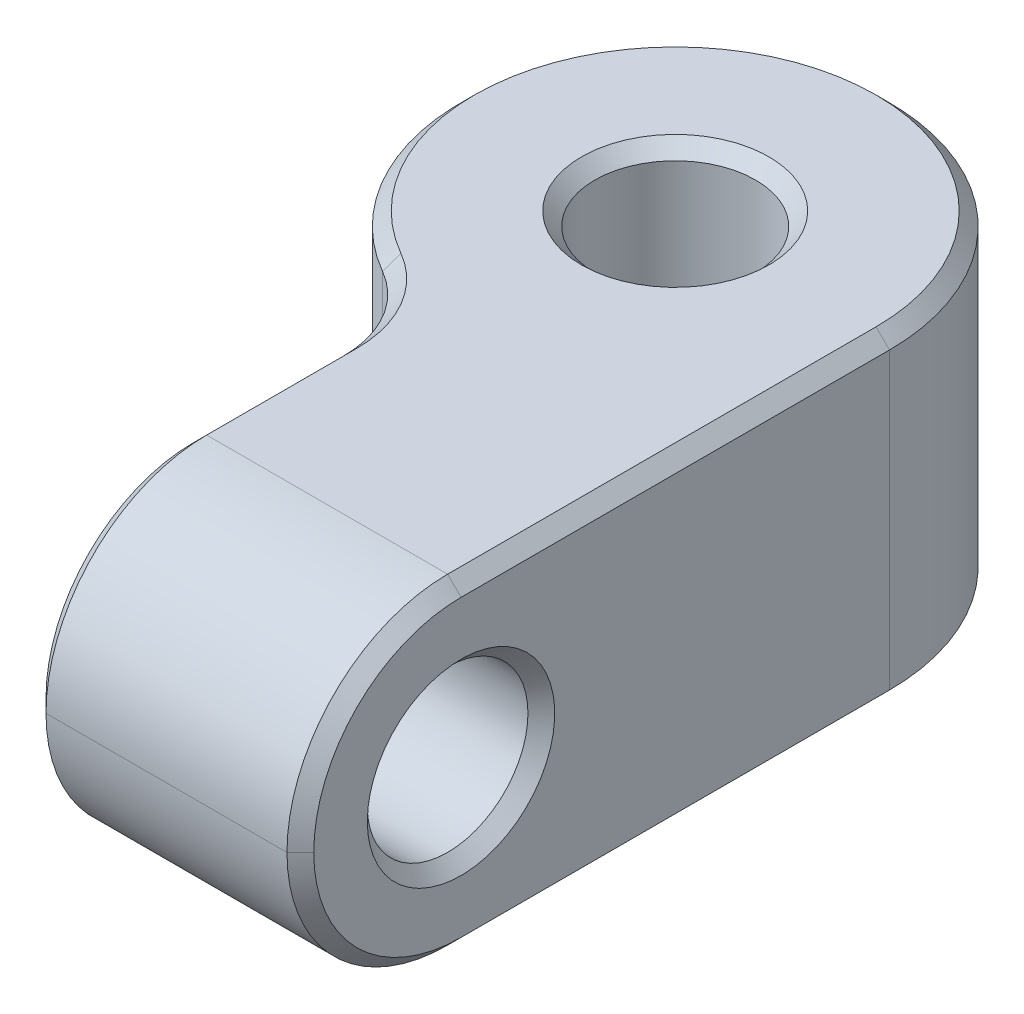
ISO-10303-21;
HEADER;
FILE_DESCRIPTION(('STEP AP214'),'2;1');
FILE_NAME('part.step','',(''),(''),'','','');
FILE_SCHEMA(('AUTOMOTIVE_DESIGN { 1 0 10303 214 1 1 1 1 }'));
ENDSEC;
DATA;
#1=APPLICATION_CONTEXT('core data for automotive mechanical design processes');
#2=APPLICATION_PROTOCOL_DEFINITION('international standard','automotive_design',2000,#1);
#3=PRODUCT_CONTEXT('',#1,'mechanical');
#4=PRODUCT('Part','Part','',(#3));
#5=PRODUCT_RELATED_PRODUCT_CATEGORY('part','',(#4));
#6=PRODUCT_DEFINITION_FORMATION('','',#4);
#7=PRODUCT_DEFINITION_CONTEXT('part definition',#1,'design');
#8=PRODUCT_DEFINITION('design','',#6,#7);
#9=PRODUCT_DEFINITION_SHAPE('','',#8);
#10=(LENGTH_UNIT() NAMED_UNIT(*) SI_UNIT(.MILLI.,.METRE.));
#11=(NAMED_UNIT(*) PLANE_ANGLE_UNIT() SI_UNIT($,.RADIAN.));
#12=(NAMED_UNIT(*) SI_UNIT($,.STERADIAN.) SOLID_ANGLE_UNIT());
#13=UNCERTAINTY_MEASURE_WITH_UNIT(LENGTH_MEASURE(1.E-05),#10,'distance_accuracy_value','');
#14=(GEOMETRIC_REPRESENTATION_CONTEXT(3) GLOBAL_UNCERTAINTY_ASSIGNED_CONTEXT((#13)) GLOBAL_UNIT_ASSIGNED_CONTEXT((#10,
#11,#12)) REPRESENTATION_CONTEXT('',''));
#15=CARTESIAN_POINT('',(0.,0.,0.));
#16=DIRECTION('',(0.,0.,1.));
#17=DIRECTION('',(1.,0.,0.));
#18=AXIS2_PLACEMENT_3D('',#15,#16,#17);
#19=CARTESIAN_POINT('',(0.,9.525,0.));
#20=DIRECTION('',(0.,1.,0.));
#21=DIRECTION('',(0.,0.,1.));
#22=AXIS2_PLACEMENT_3D('',#19,#20,#21);
#23=PLANE('',#22);
#24=CARTESIAN_POINT('',(0.,9.525,0.));
#25=DIRECTION('',(0.,1.,0.));
#26=DIRECTION('',(0.,0.,1.));
#27=AXIS2_PLACEMENT_3D('',#24,#25,#26);
#28=CIRCLE('',#27,2.77812500000001);
#29=CARTESIAN_POINT('',(0.,9.525,2.77812500000001));
#30=VERTEX_POINT('',#29);
#31=EDGE_CURVE('E151',#30,#30,#28,.F.);
#32=ORIENTED_EDGE('',*,*,#31,.T.);
#33=EDGE_LOOP('',(#32));
#34=FACE_BOUND('',#33,.T.);
#35=DIRECTION('',(1.,0.,0.));
#36=VECTOR('',#35,1.);
#37=CARTESIAN_POINT('',(6.35,9.525,12.7));
#38=LINE('',#37,#36);
#39=CARTESIAN_POINT('',(-1.19062500000002,9.525,12.7));
#40=VERTEX_POINT('',#39);
#41=CARTESIAN_POINT('',(5.95312500000002,9.525,12.7));
#42=VERTEX_POINT('',#41);
#43=EDGE_CURVE('E317',#40,#42,#38,.T.);
#44=ORIENTED_EDGE('',*,*,#43,.T.);
#45=DIRECTION('',(0.,0.,-1.));
#46=VECTOR('',#45,1.);
#47=CARTESIAN_POINT('',(5.95312500000002,9.525,0.));
#48=LINE('',#47,#46);
#49=CARTESIAN_POINT('',(5.95312500000002,9.525,0.));
#50=VERTEX_POINT('',#49);
#51=EDGE_CURVE('E238',#42,#50,#48,.T.);
#52=ORIENTED_EDGE('',*,*,#51,.T.);
#53=CARTESIAN_POINT('',(0.,9.525,0.));
#54=DIRECTION('',(0.,1.,0.));
#55=DIRECTION('',(0.,0.,1.));
#56=AXIS2_PLACEMENT_3D('',#53,#54,#55);
#57=CIRCLE('',#56,5.95312500000002);
#58=CARTESIAN_POINT('',(-2.97656250000001,9.525,5.15555748190425));
#59=VERTEX_POINT('',#58);
#60=EDGE_CURVE('E168',#50,#59,#57,.T.);
#61=ORIENTED_EDGE('',*,*,#60,.T.);
#62=CARTESIAN_POINT('',(-4.7625,9.525,8.24889197104678));
#63=DIRECTION('',(0.,1.,0.));
#64=DIRECTION('',(0.,0.,1.));
#65=AXIS2_PLACEMENT_3D('',#62,#63,#64);
#66=CIRCLE('',#65,3.57187499999998);
#67=CARTESIAN_POINT('',(-1.19062500000002,9.525,8.24889197104678));
#68=VERTEX_POINT('',#67);
#69=EDGE_CURVE('E232',#59,#68,#66,.F.);
#70=ORIENTED_EDGE('',*,*,#69,.T.);
#71=DIRECTION('',(0.,0.,1.));
#72=VECTOR('',#71,1.);
#73=CARTESIAN_POINT('',(-1.19062500000002,9.525,12.7));
#74=LINE('',#73,#72);
#75=EDGE_CURVE('E235',#68,#40,#74,.T.);
#76=ORIENTED_EDGE('',*,*,#75,.T.);
#77=EDGE_LOOP('',(#44,#52,#61,#70,#76));
#78=FACE_BOUND('',#77,.T.);
#79=ADVANCED_FACE('F43',(#34,#78),#23,.T.);
#80=CARTESIAN_POINT('',(0.,0.,0.));
#81=DIRECTION('',(0.,1.,0.));
#82=DIRECTION('',(0.,0.,1.));
#83=AXIS2_PLACEMENT_3D('',#80,#81,#82);
#84=PLANE('',#83);
#85=CARTESIAN_POINT('',(0.,0.,0.));
#86=DIRECTION('',(0.,1.,0.));
#87=DIRECTION('',(0.,0.,1.));
#88=AXIS2_PLACEMENT_3D('',#85,#86,#87);
#89=CIRCLE('',#88,2.77812499999999);
#90=CARTESIAN_POINT('',(0.,0.,2.77812499999999));
#91=VERTEX_POINT('',#90);
#92=EDGE_CURVE('E246',#91,#91,#89,.T.);
#93=ORIENTED_EDGE('',*,*,#92,.T.);
#94=EDGE_LOOP('',(#93));
#95=FACE_BOUND('',#94,.T.);
#96=CARTESIAN_POINT('',(0.,0.,0.));
#97=DIRECTION('',(0.,1.,0.));
#98=DIRECTION('',(0.,0.,1.));
#99=AXIS2_PLACEMENT_3D('',#96,#97,#98);
#100=CIRCLE('',#99,5.95312500000002);
#101=CARTESIAN_POINT('',(-2.97656250000001,0.,5.15555748190425));
#102=VERTEX_POINT('',#101);
#103=CARTESIAN_POINT('',(5.95312500000002,0.,0.));
#104=VERTEX_POINT('',#103);
#105=EDGE_CURVE('E256',#102,#104,#100,.F.);
#106=ORIENTED_EDGE('',*,*,#105,.T.);
#107=DIRECTION('',(0.,0.,1.));
#108=VECTOR('',#107,1.);
#109=CARTESIAN_POINT('',(5.95312500000002,0.,0.));
#110=LINE('',#109,#108);
#111=CARTESIAN_POINT('',(5.95312500000002,0.,12.7));
#112=VERTEX_POINT('',#111);
#113=EDGE_CURVE('E260',#104,#112,#110,.T.);
#114=ORIENTED_EDGE('',*,*,#113,.T.);
#115=DIRECTION('',(1.,0.,0.));
#116=VECTOR('',#115,1.);
#117=CARTESIAN_POINT('',(0.,0.,12.7));
#118=LINE('',#117,#116);
#119=CARTESIAN_POINT('',(-1.19062500000002,0.,12.7));
#120=VERTEX_POINT('',#119);
#121=EDGE_CURVE('E161',#112,#120,#118,.F.);
#122=ORIENTED_EDGE('',*,*,#121,.T.);
#123=DIRECTION('',(0.,0.,-1.));
#124=VECTOR('',#123,1.);
#125=CARTESIAN_POINT('',(-1.19062500000002,0.,0.));
#126=LINE('',#125,#124);
#127=CARTESIAN_POINT('',(-1.19062500000002,0.,8.24889197104678));
#128=VERTEX_POINT('',#127);
#129=EDGE_CURVE('E250',#120,#128,#126,.T.);
#130=ORIENTED_EDGE('',*,*,#129,.T.);
#131=CARTESIAN_POINT('',(-4.7625,0.,8.24889197104678));
#132=DIRECTION('',(0.,1.,0.));
#133=DIRECTION('',(0.,0.,1.));
#134=AXIS2_PLACEMENT_3D('',#131,#132,#133);
#135=CIRCLE('',#134,3.57187499999998);
#136=EDGE_CURVE('E253',#128,#102,#135,.T.);
#137=ORIENTED_EDGE('',*,*,#136,.T.);
#138=EDGE_LOOP('',(#106,#114,#122,#130,#137));
#139=FACE_BOUND('',#138,.T.);
#140=ADVANCED_FACE('F331',(#95,#139),#84,.F.);
#141=CARTESIAN_POINT('',(6.35,9.525,17.4625));
#142=DIRECTION('',(-1.,0.,0.));
#143=DIRECTION('',(0.,0.,1.));
#144=AXIS2_PLACEMENT_3D('',#141,#142,#143);
#145=PLANE('',#144);
#146=CARTESIAN_POINT('',(6.35,4.7625,12.7));
#147=DIRECTION('',(-1.,0.,0.));
#148=DIRECTION('',(0.,0.,1.));
#149=AXIS2_PLACEMENT_3D('',#146,#147,#148);
#150=CIRCLE('',#149,2.778125);
#151=CARTESIAN_POINT('',(6.35,4.7625,15.478125));
#152=VERTEX_POINT('',#151);
#153=EDGE_CURVE('E194',#152,#152,#150,.T.);
#154=ORIENTED_EDGE('',*,*,#153,.T.);
#155=EDGE_LOOP('',(#154));
#156=FACE_BOUND('',#155,.T.);
#157=CARTESIAN_POINT('',(6.35,4.7625,12.7));
#158=DIRECTION('',(-1.,0.,0.));
#159=DIRECTION('',(0.,0.,1.));
#160=AXIS2_PLACEMENT_3D('',#157,#158,#159);
#161=CIRCLE('',#160,4.36562500000002);
#162=CARTESIAN_POINT('',(6.35,4.7625,17.065625));
#163=VERTEX_POINT('',#162);
#164=CARTESIAN_POINT('',(6.35,0.396874999999985,12.7));
#165=VERTEX_POINT('',#164);
#166=EDGE_CURVE('E184',#163,#165,#161,.F.);
#167=ORIENTED_EDGE('',*,*,#166,.T.);
#168=DIRECTION('',(0.,0.,-1.));
#169=VECTOR('',#168,1.);
#170=CARTESIAN_POINT('',(6.35,0.396874999999984,17.4625));
#171=LINE('',#170,#169);
#172=CARTESIAN_POINT('',(6.35,0.396874999999988,0.));
#173=VERTEX_POINT('',#172);
#174=EDGE_CURVE('E159',#165,#173,#171,.T.);
#175=ORIENTED_EDGE('',*,*,#174,.T.);
#176=DIRECTION('',(0.,-1.,0.));
#177=VECTOR('',#176,1.);
#178=CARTESIAN_POINT('',(6.35,9.525,0.));
#179=LINE('',#178,#177);
#180=CARTESIAN_POINT('',(6.35,9.12812500000002,0.));
#181=VERTEX_POINT('',#180);
#182=EDGE_CURVE('E141',#181,#173,#179,.T.);
#183=ORIENTED_EDGE('',*,*,#182,.F.);
#184=DIRECTION('',(0.,0.,1.));
#185=VECTOR('',#184,1.);
#186=CARTESIAN_POINT('',(6.35,9.12812500000002,12.7));
#187=LINE('',#186,#185);
#188=CARTESIAN_POINT('',(6.35,9.12812500000002,12.7));
#189=VERTEX_POINT('',#188);
#190=EDGE_CURVE('E156',#181,#189,#187,.T.);
#191=ORIENTED_EDGE('',*,*,#190,.T.);
#192=CARTESIAN_POINT('',(6.35,4.7625,12.7));
#193=DIRECTION('',(-1.,0.,0.));
#194=DIRECTION('',(0.,0.,1.));
#195=AXIS2_PLACEMENT_3D('',#192,#193,#194);
#196=CIRCLE('',#195,4.36562500000002);
#197=EDGE_CURVE('E180',#189,#163,#196,.F.);
#198=ORIENTED_EDGE('',*,*,#197,.T.);
#199=EDGE_LOOP('',(#167,#175,#183,#191,#198));
#200=FACE_BOUND('',#199,.T.);
#201=ADVANCED_FACE('F154',(#156,#200),#145,.F.);
#202=CARTESIAN_POINT('',(0.,9.525,0.));
#203=DIRECTION('',(0.,-1.,0.));
#204=DIRECTION('',(0.,0.,-1.));
#205=AXIS2_PLACEMENT_3D('',#202,#203,#204);
#206=CYLINDRICAL_SURFACE('',#205,6.35);
#207=ORIENTED_EDGE('',*,*,#182,.T.);
#208=CARTESIAN_POINT('',(0.,0.396874999999984,0.));
#209=DIRECTION('',(0.,1.,0.));
#210=DIRECTION('',(0.,0.,1.));
#211=AXIS2_PLACEMENT_3D('',#208,#209,#210);
#212=CIRCLE('',#211,6.35);
#213=CARTESIAN_POINT('',(-3.175,0.396874999999988,5.49926131403119));
#214=VERTEX_POINT('',#213);
#215=EDGE_CURVE('E150',#173,#214,#212,.T.);
#216=ORIENTED_EDGE('',*,*,#215,.T.);
#217=DIRECTION('',(0.,-1.,0.));
#218=VECTOR('',#217,1.);
#219=CARTESIAN_POINT('',(-3.175,9.525,5.49926131403119));
#220=LINE('',#219,#218);
#221=CARTESIAN_POINT('',(-3.175,9.12812500000002,5.49926131403119));
#222=VERTEX_POINT('',#221);
#223=EDGE_CURVE('E144',#214,#222,#220,.F.);
#224=ORIENTED_EDGE('',*,*,#223,.T.);
#225=CARTESIAN_POINT('',(0.,9.12812500000002,0.));
#226=DIRECTION('',(0.,1.,0.));
#227=DIRECTION('',(0.,0.,1.));
#228=AXIS2_PLACEMENT_3D('',#225,#226,#227);
#229=CIRCLE('',#228,6.35);
#230=EDGE_CURVE('E137',#222,#181,#229,.F.);
#231=ORIENTED_EDGE('',*,*,#230,.T.);
#232=EDGE_LOOP('',(#207,#216,#224,#231));
#233=FACE_BOUND('',#232,.T.);
#234=ADVANCED_FACE('F139',(#233),#206,.T.);
#235=CARTESIAN_POINT('',(-1.5875,9.525,17.4625));
#236=DIRECTION('',(1.,0.,0.));
#237=DIRECTION('',(0.,0.,-1.));
#238=AXIS2_PLACEMENT_3D('',#235,#236,#237);
#239=PLANE('',#238);
#240=CARTESIAN_POINT('',(-1.5875,4.7625,12.7));
#241=DIRECTION('',(1.,0.,0.));
#242=DIRECTION('',(0.,0.,-1.));
#243=AXIS2_PLACEMENT_3D('',#240,#241,#242);
#244=CIRCLE('',#243,2.778125);
#245=CARTESIAN_POINT('',(-1.5875,4.7625,9.921875));
#246=VERTEX_POINT('',#245);
#247=EDGE_CURVE('E218',#246,#246,#244,.T.);
#248=ORIENTED_EDGE('',*,*,#247,.T.);
#249=EDGE_LOOP('',(#248));
#250=FACE_BOUND('',#249,.T.);
#251=DIRECTION('',(0.,1.,0.));
#252=VECTOR('',#251,1.);
#253=CARTESIAN_POINT('',(-1.5875,0.,8.24889197104678));
#254=LINE('',#253,#252);
#255=CARTESIAN_POINT('',(-1.5875,9.12812500000002,8.24889197104678));
#256=VERTEX_POINT('',#255);
#257=CARTESIAN_POINT('',(-1.5875,0.396874999999984,8.24889197104678));
#258=VERTEX_POINT('',#257);
#259=EDGE_CURVE('E186',#256,#258,#254,.F.);
#260=ORIENTED_EDGE('',*,*,#259,.T.);
#261=DIRECTION('',(0.,0.,1.));
#262=VECTOR('',#261,1.);
#263=CARTESIAN_POINT('',(-1.5875,0.396874999999984,17.4625));
#264=LINE('',#263,#262);
#265=CARTESIAN_POINT('',(-1.5875,0.396874999999985,12.7));
#266=VERTEX_POINT('',#265);
#267=EDGE_CURVE('E215',#258,#266,#264,.T.);
#268=ORIENTED_EDGE('',*,*,#267,.T.);
#269=CARTESIAN_POINT('',(-1.5875,4.7625,12.7));
#270=DIRECTION('',(1.,0.,0.));
#271=DIRECTION('',(0.,0.,-1.));
#272=AXIS2_PLACEMENT_3D('',#269,#270,#271);
#273=CIRCLE('',#272,4.36562500000002);
#274=CARTESIAN_POINT('',(-1.5875,4.7625,17.065625));
#275=VERTEX_POINT('',#274);
#276=EDGE_CURVE('E212',#266,#275,#273,.F.);
#277=ORIENTED_EDGE('',*,*,#276,.T.);
#278=CARTESIAN_POINT('',(-1.5875,4.7625,12.7));
#279=DIRECTION('',(1.,0.,0.));
#280=DIRECTION('',(0.,0.,-1.));
#281=AXIS2_PLACEMENT_3D('',#278,#279,#280);
#282=CIRCLE('',#281,4.36562500000002);
#283=CARTESIAN_POINT('',(-1.5875,9.12812500000002,12.7));
#284=VERTEX_POINT('',#283);
#285=EDGE_CURVE('E209',#275,#284,#282,.F.);
#286=ORIENTED_EDGE('',*,*,#285,.T.);
#287=DIRECTION('',(0.,0.,-1.));
#288=VECTOR('',#287,1.);
#289=CARTESIAN_POINT('',(-1.5875,9.12812500000002,8.24889197104678));
#290=LINE('',#289,#288);
#291=EDGE_CURVE('E206',#284,#256,#290,.T.);
#292=ORIENTED_EDGE('',*,*,#291,.T.);
#293=EDGE_LOOP('',(#260,#268,#277,#286,#292));
#294=FACE_BOUND('',#293,.T.);
#295=ADVANCED_FACE('F366',(#250,#294),#239,.F.);
#296=CARTESIAN_POINT('',(0.,9.525,0.));
#297=DIRECTION('',(0.,-1.,0.));
#298=DIRECTION('',(0.,0.,-1.));
#299=AXIS2_PLACEMENT_3D('',#296,#297,#298);
#300=CYLINDRICAL_SURFACE('',#299,2.38125);
#301=CARTESIAN_POINT('',(0.,9.12812499999999,0.));
#302=DIRECTION('',(0.,1.,0.));
#303=DIRECTION('',(0.,0.,1.));
#304=AXIS2_PLACEMENT_3D('',#301,#302,#303);
#305=CIRCLE('',#304,2.38125);
#306=CARTESIAN_POINT('',(0.,9.12812499999999,-2.38125));
#307=VERTEX_POINT('',#306);
#308=EDGE_CURVE('E226',#307,#307,#305,.T.);
#309=CARTESIAN_POINT('',(0.,0.396874999999994,0.));
#310=DIRECTION('',(0.,1.,0.));
#311=DIRECTION('',(0.,0.,1.));
#312=AXIS2_PLACEMENT_3D('',#309,#310,#311);
#313=CIRCLE('',#312,2.38125);
#314=CARTESIAN_POINT('',(0.,0.396874999999994,-2.38125));
#315=VERTEX_POINT('',#314);
#316=EDGE_CURVE('E222',#315,#315,#313,.F.);
#317=CARTESIAN_POINT('',(0.,9.12812499999999,-2.38125));
#318=CARTESIAN_POINT('',(0.,9.03717447916666,-2.38125));
#319=CARTESIAN_POINT('',(0.,8.94622395833333,-2.38125));
#320=CARTESIAN_POINT('',(0.,8.76432291666666,-2.38125));
#321=CARTESIAN_POINT('',(0.,8.67337239583332,-2.38125));
#322=CARTESIAN_POINT('',(0.,8.49147135416666,-2.38125));
#323=CARTESIAN_POINT('',(0.,8.40052083333332,-2.38125));
#324=CARTESIAN_POINT('',(0.,8.21861979166666,-2.38125));
#325=CARTESIAN_POINT('',(0.,8.12766927083332,-2.38125));
#326=CARTESIAN_POINT('',(0.,7.94576822916666,-2.38125));
#327=CARTESIAN_POINT('',(0.,7.85481770833332,-2.38125));
#328=CARTESIAN_POINT('',(0.,7.67291666666666,-2.38125));
#329=CARTESIAN_POINT('',(0.,7.58196614583332,-2.38125));
#330=CARTESIAN_POINT('',(0.,7.40006510416666,-2.38125));
#331=CARTESIAN_POINT('',(0.,7.30911458333333,-2.38125));
#332=CARTESIAN_POINT('',(0.,7.12721354166666,-2.38125));
#333=CARTESIAN_POINT('',(0.,7.03626302083332,-2.38125));
#334=CARTESIAN_POINT('',(0.,6.85436197916666,-2.38125));
#335=CARTESIAN_POINT('',(0.,6.76341145833333,-2.38125));
#336=CARTESIAN_POINT('',(0.,6.58151041666666,-2.38125));
#337=CARTESIAN_POINT('',(0.,6.49055989583333,-2.38125));
#338=CARTESIAN_POINT('',(0.,6.30865885416666,-2.38125));
#339=CARTESIAN_POINT('',(0.,6.21770833333333,-2.38125));
#340=CARTESIAN_POINT('',(0.,6.03580729166666,-2.38125));
#341=CARTESIAN_POINT('',(0.,5.94485677083332,-2.38125));
#342=CARTESIAN_POINT('',(0.,5.76295572916666,-2.38125));
#343=CARTESIAN_POINT('',(0.,5.67200520833333,-2.38125));
#344=CARTESIAN_POINT('',(0.,5.49010416666666,-2.38125));
#345=CARTESIAN_POINT('',(0.,5.39915364583333,-2.38125));
#346=CARTESIAN_POINT('',(0.,5.21725260416666,-2.38125));
#347=CARTESIAN_POINT('',(0.,5.12630208333333,-2.38125));
#348=CARTESIAN_POINT('',(0.,4.94440104166666,-2.38125));
#349=CARTESIAN_POINT('',(0.,4.85345052083333,-2.38125));
#350=CARTESIAN_POINT('',(0.,4.67154947916666,-2.38125));
#351=CARTESIAN_POINT('',(0.,4.58059895833333,-2.38125));
#352=CARTESIAN_POINT('',(0.,4.39869791666666,-2.38125));
#353=CARTESIAN_POINT('',(0.,4.30774739583333,-2.38125));
#354=CARTESIAN_POINT('',(0.,4.12584635416666,-2.38125));
#355=CARTESIAN_POINT('',(0.,4.03489583333333,-2.38125));
#356=CARTESIAN_POINT('',(0.,3.85299479166666,-2.38125));
#357=CARTESIAN_POINT('',(0.,3.76204427083333,-2.38125));
#358=CARTESIAN_POINT('',(0.,3.58014322916666,-2.38125));
#359=CARTESIAN_POINT('',(0.,3.48919270833333,-2.38125));
#360=CARTESIAN_POINT('',(0.,3.30729166666666,-2.38125));
#361=CARTESIAN_POINT('',(0.,3.21634114583333,-2.38125));
#362=CARTESIAN_POINT('',(0.,3.03444010416666,-2.38125));
#363=CARTESIAN_POINT('',(0.,2.94348958333333,-2.38125));
#364=CARTESIAN_POINT('',(0.,2.76158854166666,-2.38125));
#365=CARTESIAN_POINT('',(0.,2.67063802083333,-2.38125));
#366=CARTESIAN_POINT('',(0.,2.48873697916666,-2.38125));
#367=CARTESIAN_POINT('',(0.,2.39778645833333,-2.38125));
#368=CARTESIAN_POINT('',(0.,2.21588541666666,-2.38125));
#369=CARTESIAN_POINT('',(0.,2.12493489583333,-2.38125));
#370=CARTESIAN_POINT('',(0.,1.94303385416666,-2.38125));
#371=CARTESIAN_POINT('',(0.,1.85208333333333,-2.38125));
#372=CARTESIAN_POINT('',(0.,1.67018229166666,-2.38125));
#373=CARTESIAN_POINT('',(0.,1.57923177083333,-2.38125));
#374=CARTESIAN_POINT('',(0.,1.39733072916666,-2.38125));
#375=CARTESIAN_POINT('',(0.,1.30638020833333,-2.38125));
#376=CARTESIAN_POINT('',(0.,1.12447916666666,-2.38125));
#377=CARTESIAN_POINT('',(0.,1.03352864583333,-2.38125));
#378=CARTESIAN_POINT('',(0.,0.851627604166659,-2.38125));
#379=CARTESIAN_POINT('',(0.,0.760677083333326,-2.38125));
#380=CARTESIAN_POINT('',(0.,0.578776041666661,-2.38125));
#381=CARTESIAN_POINT('',(0.,0.487825520833328,-2.38125));
#382=CARTESIAN_POINT('',(0.,0.396874999999994,-2.38125));
#383=B_SPLINE_CURVE_WITH_KNOTS('',3,(#317,#318,#319,#320,#321,#322,#323,#324,#325,#326,#327,
#328,#329,#330,#331,#332,#333,#334,#335,#336,#337,#338,#339,#340,#341,#342,#343,#344,#345,#346,
#347,#348,#349,#350,#351,#352,#353,#354,#355,#356,#357,#358,#359,#360,#361,#362,#363,#364,#365,
#366,#367,#368,#369,#370,#371,#372,#373,#374,#375,#376,#377,#378,#379,#380,#381,#382),
.UNSPECIFIED.,.F.,.F.,(4,2,2,2,2,2,2,2,2,2,2,2,2,2,2,2,2,2,2,2,2,2,2,2,2,2,2,2,2,2,2,2,4),(0.,
0.272851562500001,0.545703125000002,0.8185546875,1.09140625,1.3642578125,1.637109375,
1.9099609375,2.1828125,2.4556640625,2.728515625,3.0013671875,3.27421875,3.5470703125,
3.819921875,4.0927734375,4.365625,4.6384765625,4.911328125,5.1841796875,5.45703125,5.7298828125,
6.002734375,6.2755859375,6.5484375,6.8212890625,7.094140625,7.3669921875,7.63984375,
7.9126953125,8.185546875,8.4583984375,8.73125),.UNSPECIFIED.);
#384=EDGE_CURVE('BSEAM382',#307,#315,#383,.T.);
#385=ORIENTED_EDGE('',*,*,#308,.T.);
#386=ORIENTED_EDGE('',*,*,#316,.T.);
#387=ORIENTED_EDGE('',*,*,#384,.T.);
#388=ORIENTED_EDGE('',*,*,#384,.F.);
#389=EDGE_LOOP('',(#385,#387,#386,#388));
#390=FACE_BOUND('',#389,.T.);
#391=ADVANCED_FACE('F382',(#390),#300,.F.);
#392=CARTESIAN_POINT('',(-6.35,4.7625,12.7));
#393=DIRECTION('',(1.,0.,0.));
#394=DIRECTION('',(0.,0.,-1.));
#395=AXIS2_PLACEMENT_3D('',#392,#393,#394);
#396=CYLINDRICAL_SURFACE('',#395,2.38125);
#397=CARTESIAN_POINT('',(5.953125,4.7625,12.7));
#398=DIRECTION('',(-1.,0.,0.));
#399=DIRECTION('',(0.,0.,1.));
#400=AXIS2_PLACEMENT_3D('',#397,#398,#399);
#401=CIRCLE('',#400,2.38125);
#402=CARTESIAN_POINT('',(5.953125,4.7625,15.08125));
#403=VERTEX_POINT('',#402);
#404=EDGE_CURVE('E202',#403,#403,#401,.F.);
#405=ORIENTED_EDGE('',*,*,#404,.T.);
#406=EDGE_LOOP('',(#405));
#407=FACE_BOUND('',#406,.T.);
#408=CARTESIAN_POINT('',(-1.190625,4.7625,12.7));
#409=DIRECTION('',(1.,0.,0.));
#410=DIRECTION('',(0.,0.,-1.));
#411=AXIS2_PLACEMENT_3D('',#408,#409,#410);
#412=CIRCLE('',#411,2.38125);
#413=CARTESIAN_POINT('',(-1.190625,4.7625,10.31875));
#414=VERTEX_POINT('',#413);
#415=EDGE_CURVE('E198',#414,#414,#412,.F.);
#416=ORIENTED_EDGE('',*,*,#415,.T.);
#417=EDGE_LOOP('',(#416));
#418=FACE_BOUND('',#417,.T.);
#419=ADVANCED_FACE('F398',(#407,#418),#396,.F.);
#420=CARTESIAN_POINT('',(0.,4.7625,12.7));
#421=DIRECTION('',(-1.,0.,0.));
#422=DIRECTION('',(0.,0.,1.));
#423=AXIS2_PLACEMENT_3D('',#420,#421,#422);
#424=CYLINDRICAL_SURFACE('',#423,4.7625);
#425=DIRECTION('',(1.,0.,0.));
#426=VECTOR('',#425,1.);
#427=CARTESIAN_POINT('',(-1.5875,4.7625,17.4625));
#428=LINE('',#427,#426);
#429=CARTESIAN_POINT('',(5.95312500000002,4.7625,17.4625));
#430=VERTEX_POINT('',#429);
#431=CARTESIAN_POINT('',(-1.19062500000002,4.7625,17.4625));
#432=VERTEX_POINT('',#431);
#433=EDGE_CURVE('E162',#430,#432,#428,.F.);
#434=ORIENTED_EDGE('',*,*,#433,.F.);
#435=CARTESIAN_POINT('',(5.95312500000002,4.7625,12.7));
#436=DIRECTION('',(-1.,0.,0.));
#437=DIRECTION('',(0.,0.,1.));
#438=AXIS2_PLACEMENT_3D('',#435,#436,#437);
#439=CIRCLE('',#438,4.7625);
#440=EDGE_CURVE('E11',#430,#42,#439,.T.);
#441=ORIENTED_EDGE('',*,*,#440,.T.);
#442=ORIENTED_EDGE('',*,*,#43,.F.);
#443=CARTESIAN_POINT('',(-1.19062500000002,4.7625,12.7));
#444=DIRECTION('',(1.,0.,0.));
#445=DIRECTION('',(0.,0.,-1.));
#446=AXIS2_PLACEMENT_3D('',#443,#444,#445);
#447=CIRCLE('',#446,4.7625);
#448=EDGE_CURVE('E54',#40,#432,#447,.T.);
#449=ORIENTED_EDGE('',*,*,#448,.T.);
#450=EDGE_LOOP('',(#434,#441,#442,#449));
#451=FACE_BOUND('',#450,.T.);
#452=ADVANCED_FACE('F360',(#451),#424,.T.);
#453=CARTESIAN_POINT('',(-1.5875,4.7625,12.7));
#454=DIRECTION('',(1.,0.,0.));
#455=DIRECTION('',(0.,0.,-1.));
#456=AXIS2_PLACEMENT_3D('',#453,#454,#455);
#457=CYLINDRICAL_SURFACE('',#456,4.7625);
#458=ORIENTED_EDGE('',*,*,#121,.F.);
#459=CARTESIAN_POINT('',(5.95312500000002,4.7625,12.7));
#460=DIRECTION('',(-1.,0.,0.));
#461=DIRECTION('',(0.,0.,1.));
#462=AXIS2_PLACEMENT_3D('',#459,#460,#461);
#463=CIRCLE('',#462,4.7625);
#464=EDGE_CURVE('E68',#112,#430,#463,.T.);
#465=ORIENTED_EDGE('',*,*,#464,.T.);
#466=ORIENTED_EDGE('',*,*,#433,.T.);
#467=CARTESIAN_POINT('',(-1.19062500000002,4.7625,12.7));
#468=DIRECTION('',(1.,0.,0.));
#469=DIRECTION('',(0.,0.,-1.));
#470=AXIS2_PLACEMENT_3D('',#467,#468,#469);
#471=CIRCLE('',#470,4.7625);
#472=EDGE_CURVE('E269',#432,#120,#471,.T.);
#473=ORIENTED_EDGE('',*,*,#472,.T.);
#474=EDGE_LOOP('',(#458,#465,#466,#473));
#475=FACE_BOUND('',#474,.T.);
#476=ADVANCED_FACE('F393',(#475),#457,.T.);
#477=CARTESIAN_POINT('',(-4.7625,9.525,8.24889197104678));
#478=DIRECTION('',(0.,-1.,0.));
#479=DIRECTION('',(0.,0.,-1.));
#480=AXIS2_PLACEMENT_3D('',#477,#478,#479);
#481=CYLINDRICAL_SURFACE('',#480,3.175);
#482=ORIENTED_EDGE('',*,*,#223,.F.);
#483=CARTESIAN_POINT('',(-4.7625,0.396874999999984,8.24889197104678));
#484=DIRECTION('',(0.,1.,0.));
#485=DIRECTION('',(0.,0.,1.));
#486=AXIS2_PLACEMENT_3D('',#483,#484,#485);
#487=CIRCLE('',#486,3.175);
#488=EDGE_CURVE('E266',#214,#258,#487,.F.);
#489=ORIENTED_EDGE('',*,*,#488,.T.);
#490=ORIENTED_EDGE('',*,*,#259,.F.);
#491=CARTESIAN_POINT('',(-4.7625,9.12812500000002,8.24889197104678));
#492=DIRECTION('',(0.,1.,0.));
#493=DIRECTION('',(0.,0.,1.));
#494=AXIS2_PLACEMENT_3D('',#491,#492,#493);
#495=CIRCLE('',#494,3.175);
#496=EDGE_CURVE('E263',#256,#222,#495,.T.);
#497=ORIENTED_EDGE('',*,*,#496,.T.);
#498=EDGE_LOOP('',(#482,#489,#490,#497));
#499=FACE_BOUND('',#498,.T.);
#500=ADVANCED_FACE('F369',(#499),#481,.F.);
#501=CARTESIAN_POINT('',(6.35,4.7625,12.7));
#502=DIRECTION('',(1.,0.,0.));
#503=DIRECTION('',(0.,0.,-1.));
#504=AXIS2_PLACEMENT_3D('',#501,#502,#503);
#505=CONICAL_SURFACE('',#504,2.778125,0.785398163397446);
#506=ORIENTED_EDGE('',*,*,#404,.F.);
#507=EDGE_LOOP('',(#506));
#508=FACE_BOUND('',#507,.T.);
#509=ORIENTED_EDGE('',*,*,#153,.F.);
#510=EDGE_LOOP('',(#509));
#511=FACE_BOUND('',#510,.T.);
#512=ADVANCED_FACE('F401',(#508,#511),#505,.F.);
#513=CARTESIAN_POINT('',(-1.5875,4.7625,12.7));
#514=DIRECTION('',(-1.,0.,0.));
#515=DIRECTION('',(0.,0.,1.));
#516=AXIS2_PLACEMENT_3D('',#513,#514,#515);
#517=CONICAL_SURFACE('',#516,2.778125,0.785398163397447);
#518=ORIENTED_EDGE('',*,*,#415,.F.);
#519=EDGE_LOOP('',(#518));
#520=FACE_BOUND('',#519,.T.);
#521=ORIENTED_EDGE('',*,*,#247,.F.);
#522=EDGE_LOOP('',(#521));
#523=FACE_BOUND('',#522,.T.);
#524=ADVANCED_FACE('F408',(#520,#523),#517,.F.);
#525=CARTESIAN_POINT('',(0.,9.12812499999999,0.));
#526=DIRECTION('',(0.,1.,0.));
#527=DIRECTION('',(0.,0.,1.));
#528=AXIS2_PLACEMENT_3D('',#525,#526,#527);
#529=CONICAL_SURFACE('',#528,2.38125,0.785398163397449);
#530=ORIENTED_EDGE('',*,*,#31,.F.);
#531=EDGE_LOOP('',(#530));
#532=FACE_BOUND('',#531,.T.);
#533=ORIENTED_EDGE('',*,*,#308,.F.);
#534=EDGE_LOOP('',(#533));
#535=FACE_BOUND('',#534,.T.);
#536=ADVANCED_FACE('F415',(#532,#535),#529,.F.);
#537=CARTESIAN_POINT('',(-4.7625,9.525,8.24889197104678));
#538=DIRECTION('',(0.,1.,0.));
#539=DIRECTION('',(0.,0.,1.));
#540=AXIS2_PLACEMENT_3D('',#537,#538,#539);
#541=CONICAL_SURFACE('',#540,3.57187499999998,0.785398163397446);
#542=DIRECTION('',(-0.707106781186546,-0.707106781186549,0.));
#543=VECTOR('',#542,1.);
#544=CARTESIAN_POINT('',(-1.19062500000002,9.525,8.24889197104678));
#545=LINE('',#544,#543);
#546=EDGE_CURVE('E172',#68,#256,#545,.T.);
#547=ORIENTED_EDGE('',*,*,#546,.F.);
#548=ORIENTED_EDGE('',*,*,#69,.F.);
#549=DIRECTION('',(0.353553390593273,0.70710678118655,-0.612372435695793));
#550=VECTOR('',#549,1.);
#551=CARTESIAN_POINT('',(-3.175,9.12812500000002,5.49926131403118));
#552=LINE('',#551,#550);
#553=EDGE_CURVE('E48',#222,#59,#552,.T.);
#554=ORIENTED_EDGE('',*,*,#553,.F.);
#555=ORIENTED_EDGE('',*,*,#496,.F.);
#556=EDGE_LOOP('',(#547,#548,#554,#555));
#557=FACE_BOUND('',#556,.T.);
#558=ADVANCED_FACE('F371',(#557),#541,.F.);
#559=CARTESIAN_POINT('',(0.,9.525,0.));
#560=DIRECTION('',(0.,-1.,0.));
#561=DIRECTION('',(0.,0.,-1.));
#562=AXIS2_PLACEMENT_3D('',#559,#560,#561);
#563=CONICAL_SURFACE('',#562,5.95312500000002,0.785398163397445);
#564=ORIENTED_EDGE('',*,*,#553,.T.);
#565=ORIENTED_EDGE('',*,*,#60,.F.);
#566=DIRECTION('',(-0.707106781186545,0.70710678118655,0.));
#567=VECTOR('',#566,1.);
#568=CARTESIAN_POINT('',(6.35,9.12812500000002,0.));
#569=LINE('',#568,#567);
#570=EDGE_CURVE('E166',#181,#50,#569,.T.);
#571=ORIENTED_EDGE('',*,*,#570,.F.);
#572=ORIENTED_EDGE('',*,*,#230,.F.);
#573=EDGE_LOOP('',(#564,#565,#571,#572));
#574=FACE_BOUND('',#573,.T.);
#575=ADVANCED_FACE('F167',(#574),#563,.T.);
#576=CARTESIAN_POINT('',(-1.19062500000002,9.525,0.));
#577=DIRECTION('',(-0.707106781186549,0.707106781186546,0.));
#578=DIRECTION('',(0.,0.,-1.));
#579=AXIS2_PLACEMENT_3D('',#576,#577,#578);
#580=PLANE('',#579);
#581=ORIENTED_EDGE('',*,*,#546,.T.);
#582=ORIENTED_EDGE('',*,*,#291,.F.);
#583=DIRECTION('',(-0.707106781186546,-0.707106781186549,0.));
#584=VECTOR('',#583,1.);
#585=CARTESIAN_POINT('',(-1.19062500000002,9.525,12.7));
#586=LINE('',#585,#584);
#587=EDGE_CURVE('E173',#40,#284,#586,.T.);
#588=ORIENTED_EDGE('',*,*,#587,.F.);
#589=ORIENTED_EDGE('',*,*,#75,.F.);
#590=EDGE_LOOP('',(#581,#582,#588,#589));
#591=FACE_BOUND('',#590,.T.);
#592=ADVANCED_FACE('F362',(#591),#580,.T.);
#593=CARTESIAN_POINT('',(5.95312500000002,9.525,0.));
#594=DIRECTION('',(0.70710678118655,0.707106781186545,0.));
#595=DIRECTION('',(0.,0.,1.));
#596=AXIS2_PLACEMENT_3D('',#593,#594,#595);
#597=PLANE('',#596);
#598=ORIENTED_EDGE('',*,*,#570,.T.);
#599=ORIENTED_EDGE('',*,*,#51,.F.);
#600=DIRECTION('',(-0.707106781186545,0.70710678118655,0.));
#601=VECTOR('',#600,1.);
#602=CARTESIAN_POINT('',(6.35,9.12812500000002,12.7));
#603=LINE('',#602,#601);
#604=EDGE_CURVE('E177',#189,#42,#603,.T.);
#605=ORIENTED_EDGE('',*,*,#604,.F.);
#606=ORIENTED_EDGE('',*,*,#190,.F.);
#607=EDGE_LOOP('',(#598,#599,#605,#606));
#608=FACE_BOUND('',#607,.T.);
#609=ADVANCED_FACE('F175',(#608),#597,.T.);
#610=CARTESIAN_POINT('',(-1.5875,4.7625,12.7));
#611=DIRECTION('',(1.,0.,0.));
#612=DIRECTION('',(0.,0.,-1.));
#613=AXIS2_PLACEMENT_3D('',#610,#611,#612);
#614=CONICAL_SURFACE('',#613,4.36562500000002,0.785398163397451);
#615=ORIENTED_EDGE('',*,*,#587,.T.);
#616=ORIENTED_EDGE('',*,*,#285,.F.);
#617=DIRECTION('',(-0.707106781186546,0.,-0.707106781186549));
#618=VECTOR('',#617,1.);
#619=CARTESIAN_POINT('',(-1.19062500000002,4.7625,17.4625));
#620=LINE('',#619,#618);
#621=EDGE_CURVE('E298',#432,#275,#620,.T.);
#622=ORIENTED_EDGE('',*,*,#621,.F.);
#623=ORIENTED_EDGE('',*,*,#448,.F.);
#624=EDGE_LOOP('',(#615,#616,#622,#623));
#625=FACE_BOUND('',#624,.T.);
#626=ADVANCED_FACE('F365',(#625),#614,.T.);
#627=CARTESIAN_POINT('',(6.35,4.7625,12.7));
#628=DIRECTION('',(-1.,0.,0.));
#629=DIRECTION('',(0.,0.,1.));
#630=AXIS2_PLACEMENT_3D('',#627,#628,#629);
#631=CONICAL_SURFACE('',#630,4.36562500000002,0.785398163397453);
#632=ORIENTED_EDGE('',*,*,#604,.T.);
#633=ORIENTED_EDGE('',*,*,#440,.F.);
#634=DIRECTION('',(-0.707106781186545,0.,0.70710678118655));
#635=VECTOR('',#634,1.);
#636=CARTESIAN_POINT('',(6.35,4.7625,17.065625));
#637=LINE('',#636,#635);
#638=EDGE_CURVE('E294',#163,#430,#637,.T.);
#639=ORIENTED_EDGE('',*,*,#638,.F.);
#640=ORIENTED_EDGE('',*,*,#197,.F.);
#641=EDGE_LOOP('',(#632,#633,#639,#640));
#642=FACE_BOUND('',#641,.T.);
#643=ADVANCED_FACE('F359',(#642),#631,.T.);
#644=CARTESIAN_POINT('',(-1.5875,4.7625,12.7));
#645=DIRECTION('',(1.,0.,0.));
#646=DIRECTION('',(0.,0.,-1.));
#647=AXIS2_PLACEMENT_3D('',#644,#645,#646);
#648=CONICAL_SURFACE('',#647,4.36562500000002,0.785398163397452);
#649=ORIENTED_EDGE('',*,*,#621,.T.);
#650=ORIENTED_EDGE('',*,*,#276,.F.);
#651=DIRECTION('',(-0.707106781186545,0.70710678118655,0.));
#652=VECTOR('',#651,1.);
#653=CARTESIAN_POINT('',(-1.19062500000002,0.,12.7));
#654=LINE('',#653,#652);
#655=EDGE_CURVE('E290',#120,#266,#654,.T.);
#656=ORIENTED_EDGE('',*,*,#655,.F.);
#657=ORIENTED_EDGE('',*,*,#472,.F.);
#658=EDGE_LOOP('',(#649,#650,#656,#657));
#659=FACE_BOUND('',#658,.T.);
#660=ADVANCED_FACE('F338',(#659),#648,.T.);
#661=CARTESIAN_POINT('',(6.35,4.7625,12.7));
#662=DIRECTION('',(-1.,0.,0.));
#663=DIRECTION('',(0.,0.,1.));
#664=AXIS2_PLACEMENT_3D('',#661,#662,#663);
#665=CONICAL_SURFACE('',#664,4.36562500000002,0.785398163397453);
#666=ORIENTED_EDGE('',*,*,#638,.T.);
#667=ORIENTED_EDGE('',*,*,#464,.F.);
#668=DIRECTION('',(-0.707106781186544,-0.70710678118655,0.));
#669=VECTOR('',#668,1.);
#670=CARTESIAN_POINT('',(6.35,0.396874999999985,12.7));
#671=LINE('',#670,#669);
#672=EDGE_CURVE('E286',#165,#112,#671,.T.);
#673=ORIENTED_EDGE('',*,*,#672,.F.);
#674=ORIENTED_EDGE('',*,*,#166,.F.);
#675=EDGE_LOOP('',(#666,#667,#673,#674));
#676=FACE_BOUND('',#675,.T.);
#677=ADVANCED_FACE('F355',(#676),#665,.T.);
#678=CARTESIAN_POINT('',(-1.5875,0.396874999999984,17.4625));
#679=DIRECTION('',(0.707106781186549,0.707106781186546,0.));
#680=DIRECTION('',(0.,0.,1.));
#681=AXIS2_PLACEMENT_3D('',#678,#679,#680);
#682=PLANE('',#681);
#683=ORIENTED_EDGE('',*,*,#655,.T.);
#684=ORIENTED_EDGE('',*,*,#267,.F.);
#685=DIRECTION('',(-0.707106781186546,0.707106781186549,0.));
#686=VECTOR('',#685,1.);
#687=CARTESIAN_POINT('',(-1.19062500000002,0.,8.24889197104678));
#688=LINE('',#687,#686);
#689=EDGE_CURVE('E282',#128,#258,#688,.T.);
#690=ORIENTED_EDGE('',*,*,#689,.F.);
#691=ORIENTED_EDGE('',*,*,#129,.F.);
#692=EDGE_LOOP('',(#683,#684,#690,#691));
#693=FACE_BOUND('',#692,.T.);
#694=ADVANCED_FACE('F340',(#693),#682,.F.);
#695=CARTESIAN_POINT('',(6.35,0.396874999999984,17.4625));
#696=DIRECTION('',(-0.70710678118655,0.707106781186545,0.));
#697=DIRECTION('',(0.,0.,-1.));
#698=AXIS2_PLACEMENT_3D('',#695,#696,#697);
#699=PLANE('',#698);
#700=ORIENTED_EDGE('',*,*,#672,.T.);
#701=ORIENTED_EDGE('',*,*,#113,.F.);
#702=DIRECTION('',(-0.707106781186545,-0.70710678118655,0.));
#703=VECTOR('',#702,1.);
#704=CARTESIAN_POINT('',(6.35,0.396874999999984,0.));
#705=LINE('',#704,#703);
#706=EDGE_CURVE('E279',#173,#104,#705,.T.);
#707=ORIENTED_EDGE('',*,*,#706,.F.);
#708=ORIENTED_EDGE('',*,*,#174,.F.);
#709=EDGE_LOOP('',(#700,#701,#707,#708));
#710=FACE_BOUND('',#709,.T.);
#711=ADVANCED_FACE('F351',(#710),#699,.F.);
#712=CARTESIAN_POINT('',(-4.7625,0.,8.24889197104678));
#713=DIRECTION('',(0.,-1.,0.));
#714=DIRECTION('',(0.,0.,-1.));
#715=AXIS2_PLACEMENT_3D('',#712,#713,#714);
#716=CONICAL_SURFACE('',#715,3.57187499999998,0.785398163397446);
#717=ORIENTED_EDGE('',*,*,#689,.T.);
#718=ORIENTED_EDGE('',*,*,#488,.F.);
#719=DIRECTION('',(-0.353553390593273,0.70710678118655,0.612372435695793));
#720=VECTOR('',#719,1.);
#721=CARTESIAN_POINT('',(-2.97656250000001,0.,5.15555748190425));
#722=LINE('',#721,#720);
#723=EDGE_CURVE('E276',#102,#214,#722,.T.);
#724=ORIENTED_EDGE('',*,*,#723,.F.);
#725=ORIENTED_EDGE('',*,*,#136,.F.);
#726=EDGE_LOOP('',(#717,#718,#724,#725));
#727=FACE_BOUND('',#726,.T.);
#728=ADVANCED_FACE('F345',(#727),#716,.F.);
#729=CARTESIAN_POINT('',(0.,0.396874999999984,0.));
#730=DIRECTION('',(0.,1.,0.));
#731=DIRECTION('',(0.,0.,1.));
#732=AXIS2_PLACEMENT_3D('',#729,#730,#731);
#733=CONICAL_SURFACE('',#732,6.35,0.785398163397446);
#734=ORIENTED_EDGE('',*,*,#706,.T.);
#735=ORIENTED_EDGE('',*,*,#105,.F.);
#736=ORIENTED_EDGE('',*,*,#723,.T.);
#737=ORIENTED_EDGE('',*,*,#215,.F.);
#738=EDGE_LOOP('',(#734,#735,#736,#737));
#739=FACE_BOUND('',#738,.T.);
#740=ADVANCED_FACE('F348',(#739),#733,.T.);
#741=CARTESIAN_POINT('',(0.,0.,0.));
#742=DIRECTION('',(0.,-1.,0.));
#743=DIRECTION('',(0.,0.,-1.));
#744=AXIS2_PLACEMENT_3D('',#741,#742,#743);
#745=CONICAL_SURFACE('',#744,2.77812499999999,0.785398163397445);
#746=ORIENTED_EDGE('',*,*,#316,.F.);
#747=EDGE_LOOP('',(#746));
#748=FACE_BOUND('',#747,.T.);
#749=ORIENTED_EDGE('',*,*,#92,.F.);
#750=EDGE_LOOP('',(#749));
#751=FACE_BOUND('',#750,.T.);
#752=ADVANCED_FACE('F46',(#748,#751),#745,.F.);
#753=CLOSED_SHELL('',(#79,#140,#201,#234,#295,#391,#419,#452,#476,#500,#512,#524,#536,#558,#575,
#592,#609,#626,#643,#660,#677,#694,#711,#728,#740,#752));
#754=MANIFOLD_SOLID_BREP('B2',#753);
#755=ADVANCED_BREP_SHAPE_REPRESENTATION('',(#18,#754),#14);
#756=SHAPE_DEFINITION_REPRESENTATION(#9,#755);
ENDSEC;
END-ISO-10303-21;
